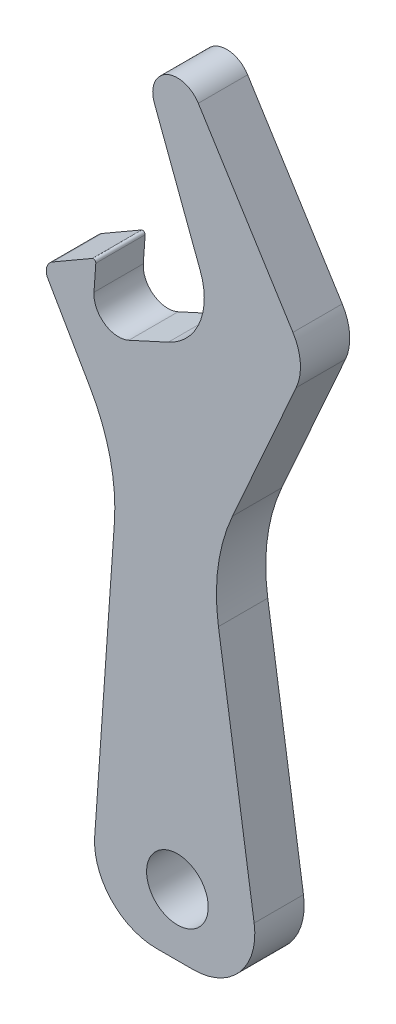
ISO-10303-21;
HEADER;
FILE_DESCRIPTION(('STEP AP214'),'2;1');
FILE_NAME('part.step','',(''),(''),'','','');
FILE_SCHEMA(('AUTOMOTIVE_DESIGN { 1 0 10303 214 1 1 1 1 }'));
ENDSEC;
DATA;
#1=APPLICATION_CONTEXT('core data for automotive mechanical design processes');
#2=APPLICATION_PROTOCOL_DEFINITION('international standard','automotive_design',2000,#1);
#3=PRODUCT_CONTEXT('',#1,'mechanical');
#4=PRODUCT('Part','Part','',(#3));
#5=PRODUCT_RELATED_PRODUCT_CATEGORY('part','',(#4));
#6=PRODUCT_DEFINITION_FORMATION('','',#4);
#7=PRODUCT_DEFINITION_CONTEXT('part definition',#1,'design');
#8=PRODUCT_DEFINITION('design','',#6,#7);
#9=PRODUCT_DEFINITION_SHAPE('','',#8);
#10=(LENGTH_UNIT() NAMED_UNIT(*) SI_UNIT(.MILLI.,.METRE.));
#11=(NAMED_UNIT(*) PLANE_ANGLE_UNIT() SI_UNIT($,.RADIAN.));
#12=(NAMED_UNIT(*) SI_UNIT($,.STERADIAN.) SOLID_ANGLE_UNIT());
#13=UNCERTAINTY_MEASURE_WITH_UNIT(LENGTH_MEASURE(1.E-05),#10,'distance_accuracy_value','');
#14=(GEOMETRIC_REPRESENTATION_CONTEXT(3) GLOBAL_UNCERTAINTY_ASSIGNED_CONTEXT((#13)) GLOBAL_UNIT_ASSIGNED_CONTEXT((#10,
#11,#12)) REPRESENTATION_CONTEXT('',''));
#15=CARTESIAN_POINT('',(0.,0.,0.));
#16=DIRECTION('',(0.,0.,1.));
#17=DIRECTION('',(1.,0.,0.));
#18=AXIS2_PLACEMENT_3D('',#15,#16,#17);
#19=CARTESIAN_POINT('',(0.,55.,4.));
#20=DIRECTION('',(0.,0.,1.));
#21=DIRECTION('',(1.,0.,0.));
#22=AXIS2_PLACEMENT_3D('',#19,#20,#21);
#23=PLANE('',#22);
#24=CARTESIAN_POINT('',(0.,55.,4.));
#25=DIRECTION('',(0.,0.,1.));
#26=DIRECTION('',(1.,0.,0.));
#27=AXIS2_PLACEMENT_3D('',#24,#25,#26);
#28=CIRCLE('',#27,2.);
#29=CARTESIAN_POINT('',(1.69510173893988,56.0614283276053,4.));
#30=VERTEX_POINT('',#29);
#31=CARTESIAN_POINT('',(-1.87218432235633,54.2964903247835,4.));
#32=VERTEX_POINT('',#31);
#33=EDGE_CURVE('E242',#30,#32,#28,.T.);
#34=ORIENTED_EDGE('',*,*,#33,.T.);
#35=DIRECTION('',(0.351754837608238,-0.936092161178162,0.));
#36=VECTOR('',#35,1.);
#37=CARTESIAN_POINT('',(-1.87218432235633,54.2964903247835,4.));
#38=LINE('',#37,#36);
#39=CARTESIAN_POINT('',(1.85912681998929,44.3667019101702,4.));
#40=VERTEX_POINT('',#39);
#41=EDGE_CURVE('E130',#32,#40,#38,.T.);
#42=ORIENTED_EDGE('',*,*,#41,.T.);
#43=CARTESIAN_POINT('',(-2.8213339859015,42.607927722129,4.));
#44=DIRECTION('',(0.,0.,-1.));
#45=DIRECTION('',(-1.,0.,0.));
#46=AXIS2_PLACEMENT_3D('',#43,#44,#45);
#47=CIRCLE('',#46,5.);
#48=CARTESIAN_POINT('',(-0.742535184562563,38.0605553442,4.));
#49=VERTEX_POINT('',#48);
#50=EDGE_CURVE('E293',#40,#49,#47,.T.);
#51=ORIENTED_EDGE('',*,*,#50,.T.);
#52=DIRECTION('',(-0.909474475585801,-0.415759760267793,0.));
#53=VECTOR('',#52,1.);
#54=CARTESIAN_POINT('',(-0.742535184562563,38.0605553442,4.));
#55=LINE('',#54,#53);
#56=CARTESIAN_POINT('',(-3.93853906050979,36.5995250009098,4.));
#57=VERTEX_POINT('',#56);
#58=EDGE_CURVE('E312',#49,#57,#55,.T.);
#59=ORIENTED_EDGE('',*,*,#58,.T.);
#60=CARTESIAN_POINT('',(-4.7700585810454,38.4184739520814,4.));
#61=DIRECTION('',(0.,0.,-1.));
#62=DIRECTION('',(-1.,0.,0.));
#63=AXIS2_PLACEMENT_3D('',#60,#61,#62);
#64=CIRCLE('',#63,2.);
#65=CARTESIAN_POINT('',(-6.76518668156505,38.5579868995697,4.));
#66=VERTEX_POINT('',#65);
#67=EDGE_CURVE('E309',#57,#66,#64,.T.);
#68=ORIENTED_EDGE('',*,*,#67,.T.);
#69=DIRECTION('',(0.0697564737441167,0.997564050259825,0.));
#70=VECTOR('',#69,1.);
#71=CARTESIAN_POINT('',(-6.76518668156505,38.5579868995697,4.));
#72=LINE('',#71,#70);
#73=CARTESIAN_POINT('',(-6.61748888501032,40.6701637949509,4.));
#74=VERTEX_POINT('',#73);
#75=EDGE_CURVE('E311',#66,#74,#72,.T.);
#76=ORIENTED_EDGE('',*,*,#75,.T.);
#77=CARTESIAN_POINT('',(-6.81700169506228,40.6841150896997,4.));
#78=DIRECTION('',(0.,0.,1.));
#79=DIRECTION('',(-1.,0.,0.));
#80=AXIS2_PLACEMENT_3D('',#77,#78,#79);
#81=CIRCLE('',#80,0.199999999999999);
#82=CARTESIAN_POINT('',(-6.91700169506228,40.8573201704566,4.));
#83=VERTEX_POINT('',#82);
#84=EDGE_CURVE('E314',#74,#83,#81,.T.);
#85=ORIENTED_EDGE('',*,*,#84,.T.);
#86=DIRECTION('',(-0.866025403784437,-0.500000000000003,0.));
#87=VECTOR('',#86,1.);
#88=CARTESIAN_POINT('',(-6.91700169506228,40.8573201704566,4.));
#89=LINE('',#88,#87);
#90=CARTESIAN_POINT('',(-10.1339745962156,39.,4.));
#91=VERTEX_POINT('',#90);
#92=EDGE_CURVE('E320',#83,#91,#89,.T.);
#93=ORIENTED_EDGE('',*,*,#92,.T.);
#94=CARTESIAN_POINT('',(-9.63397459621556,38.1339745962156,4.));
#95=DIRECTION('',(0.,0.,1.));
#96=DIRECTION('',(1.,0.,0.));
#97=AXIS2_PLACEMENT_3D('',#94,#95,#96);
#98=CIRCLE('',#97,1.);
#99=CARTESIAN_POINT('',(-10.5,37.6339745962156,4.));
#100=VERTEX_POINT('',#99);
#101=EDGE_CURVE('E322',#91,#100,#98,.T.);
#102=ORIENTED_EDGE('',*,*,#101,.T.);
#103=DIRECTION('',(0.500000000000006,-0.866025403784435,0.));
#104=VECTOR('',#103,1.);
#105=CARTESIAN_POINT('',(-10.5,37.6339745962156,4.));
#106=LINE('',#105,#104);
#107=CARTESIAN_POINT('',(-7.08532915368752,31.7195911992782,4.));
#108=VERTEX_POINT('',#107);
#109=EDGE_CURVE('E324',#100,#108,#106,.T.);
#110=ORIENTED_EDGE('',*,*,#109,.T.);
#111=CARTESIAN_POINT('',(-20.0757102104541,24.2195911992781,4.));
#112=DIRECTION('',(0.,0.,-1.));
#113=DIRECTION('',(-1.,0.,0.));
#114=AXIS2_PLACEMENT_3D('',#111,#112,#113);
#115=CIRCLE('',#114,15.);
#116=CARTESIAN_POINT('',(-5.11224945655669,23.1732440931163,4.));
#117=VERTEX_POINT('',#116);
#118=EDGE_CURVE('E326',#108,#117,#115,.T.);
#119=ORIENTED_EDGE('',*,*,#118,.T.);
#120=DIRECTION('',(-0.0697564737441258,-0.997564050259824,0.));
#121=VECTOR('',#120,1.);
#122=CARTESIAN_POINT('',(-5.11224945655669,23.1732440931163,4.));
#123=LINE('',#122,#121);
#124=CARTESIAN_POINT('',(-6.70829129927037,0.348782368720628,4.));
#125=VERTEX_POINT('',#124);
#126=EDGE_CURVE('E328',#117,#125,#123,.T.);
#127=ORIENTED_EDGE('',*,*,#126,.T.);
#128=CARTESIAN_POINT('',(-1.72047104797125,0.,4.));
#129=DIRECTION('',(0.,0.,1.));
#130=DIRECTION('',(-1.,0.,0.));
#131=AXIS2_PLACEMENT_3D('',#128,#129,#130);
#132=CIRCLE('',#131,5.);
#133=CARTESIAN_POINT('',(-1.72047104797125,-5.,4.));
#134=VERTEX_POINT('',#133);
#135=EDGE_CURVE('E330',#125,#134,#132,.T.);
#136=ORIENTED_EDGE('',*,*,#135,.T.);
#137=DIRECTION('',(1.,0.,0.));
#138=VECTOR('',#137,1.);
#139=CARTESIAN_POINT('',(-1.72047104797125,-5.,4.));
#140=LINE('',#139,#138);
#141=CARTESIAN_POINT('',(1.27952895202875,-5.,4.));
#142=VERTEX_POINT('',#141);
#143=EDGE_CURVE('E332',#134,#142,#140,.T.);
#144=ORIENTED_EDGE('',*,*,#143,.T.);
#145=CARTESIAN_POINT('',(1.27952895202875,0.,4.));
#146=DIRECTION('',(0.,0.,1.));
#147=DIRECTION('',(1.,0.,0.));
#148=AXIS2_PLACEMENT_3D('',#145,#146,#147);
#149=CIRCLE('',#148,5.);
#150=CARTESIAN_POINT('',(6.22460826883834,0.739047055648021,4.));
#151=VERTEX_POINT('',#150);
#152=EDGE_CURVE('E334',#142,#151,#149,.T.);
#153=ORIENTED_EDGE('',*,*,#152,.T.);
#154=DIRECTION('',(-0.147809411129604,0.989015863361918,0.));
#155=VECTOR('',#154,1.);
#156=CARTESIAN_POINT('',(6.22460826883834,0.739047055648021,4.));
#157=LINE('',#156,#155);
#158=CARTESIAN_POINT('',(3.32854071791424,20.1170875156033,4.));
#159=VERTEX_POINT('',#158);
#160=EDGE_CURVE('E336',#151,#159,#157,.T.);
#161=ORIENTED_EDGE('',*,*,#160,.T.);
#162=CARTESIAN_POINT('',(18.163778668343,22.3342286825474,4.));
#163=DIRECTION('',(0.,0.,-1.));
#164=DIRECTION('',(-1.,0.,0.));
#165=AXIS2_PLACEMENT_3D('',#162,#163,#164);
#166=CIRCLE('',#165,15.);
#167=CARTESIAN_POINT('',(4.46059680370396,28.4352783286843,4.));
#168=VERTEX_POINT('',#167);
#169=EDGE_CURVE('E185',#159,#168,#166,.T.);
#170=ORIENTED_EDGE('',*,*,#169,.T.);
#171=DIRECTION('',(0.406736643075797,0.913545457642602,0.));
#172=VECTOR('',#171,1.);
#173=CARTESIAN_POINT('',(4.46059680370396,28.4352783286843,4.));
#174=LINE('',#173,#172);
#175=CARTESIAN_POINT('',(9.63395857258165,40.0548391062939,4.));
#176=VERTEX_POINT('',#175);
#177=EDGE_CURVE('E179',#168,#176,#174,.T.);
#178=ORIENTED_EDGE('',*,*,#177,.T.);
#179=CARTESIAN_POINT('',(5.97977674201125,41.6817856785971,4.));
#180=DIRECTION('',(0.,0.,1.));
#181=DIRECTION('',(1.,0.,0.));
#182=AXIS2_PLACEMENT_3D('',#179,#180,#181);
#183=CIRCLE('',#182,4.);
#184=CARTESIAN_POINT('',(9.36998021989102,43.8046423338077,4.));
#185=VERTEX_POINT('',#184);
#186=EDGE_CURVE('E183',#176,#185,#183,.T.);
#187=ORIENTED_EDGE('',*,*,#186,.T.);
#188=DIRECTION('',(-0.530714163802647,0.847550869469943,0.));
#189=VECTOR('',#188,1.);
#190=CARTESIAN_POINT('',(9.36998021989102,43.8046423338077,4.));
#191=LINE('',#190,#189);
#192=EDGE_CURVE('E51',#185,#30,#191,.T.);
#193=ORIENTED_EDGE('',*,*,#192,.T.);
#194=EDGE_LOOP('',(#34,#42,#51,#59,#68,#76,#85,#93,#102,#110,#119,#127,#136,#144,#153,#161,#170,
#178,#187,#193));
#195=FACE_BOUND('',#194,.T.);
#196=CARTESIAN_POINT('',(0.,0.,4.));
#197=DIRECTION('',(0.,0.,1.));
#198=DIRECTION('',(1.,0.,0.));
#199=AXIS2_PLACEMENT_3D('',#196,#197,#198);
#200=CIRCLE('',#199,2.5);
#201=CARTESIAN_POINT('',(2.5,0.,4.));
#202=VERTEX_POINT('',#201);
#203=EDGE_CURVE('E207',#202,#202,#200,.T.);
#204=ORIENTED_EDGE('',*,*,#203,.F.);
#205=EDGE_LOOP('',(#204));
#206=FACE_BOUND('',#205,.T.);
#207=ADVANCED_FACE('F34',(#195,#206),#23,.T.);
#208=CARTESIAN_POINT('',(0.,55.,0.));
#209=DIRECTION('',(0.,0.,1.));
#210=DIRECTION('',(1.,0.,0.));
#211=AXIS2_PLACEMENT_3D('',#208,#209,#210);
#212=PLANE('',#211);
#213=CARTESIAN_POINT('',(0.,55.,0.));
#214=DIRECTION('',(0.,0.,1.));
#215=DIRECTION('',(1.,0.,0.));
#216=AXIS2_PLACEMENT_3D('',#213,#214,#215);
#217=CIRCLE('',#216,2.);
#218=CARTESIAN_POINT('',(1.69510173893988,56.0614283276053,0.));
#219=VERTEX_POINT('',#218);
#220=CARTESIAN_POINT('',(-1.87218432235633,54.2964903247835,0.));
#221=VERTEX_POINT('',#220);
#222=EDGE_CURVE('E203',#219,#221,#217,.T.);
#223=ORIENTED_EDGE('',*,*,#222,.F.);
#224=DIRECTION('',(-0.530714163802647,0.847550869469943,0.));
#225=VECTOR('',#224,1.);
#226=CARTESIAN_POINT('',(9.36998021989102,43.8046423338077,0.));
#227=LINE('',#226,#225);
#228=CARTESIAN_POINT('',(9.36998021989102,43.8046423338077,0.));
#229=VERTEX_POINT('',#228);
#230=EDGE_CURVE('E122',#229,#219,#227,.T.);
#231=ORIENTED_EDGE('',*,*,#230,.F.);
#232=CARTESIAN_POINT('',(5.97977674201125,41.6817856785971,0.));
#233=DIRECTION('',(0.,0.,1.));
#234=DIRECTION('',(1.,0.,0.));
#235=AXIS2_PLACEMENT_3D('',#232,#233,#234);
#236=CIRCLE('',#235,4.);
#237=CARTESIAN_POINT('',(9.63395857258165,40.0548391062939,0.));
#238=VERTEX_POINT('',#237);
#239=EDGE_CURVE('E116',#238,#229,#236,.T.);
#240=ORIENTED_EDGE('',*,*,#239,.F.);
#241=DIRECTION('',(0.406736643075797,0.913545457642602,0.));
#242=VECTOR('',#241,1.);
#243=CARTESIAN_POINT('',(4.46059680370396,28.4352783286843,0.));
#244=LINE('',#243,#242);
#245=CARTESIAN_POINT('',(4.46059680370396,28.4352783286843,0.));
#246=VERTEX_POINT('',#245);
#247=EDGE_CURVE('E193',#246,#238,#244,.T.);
#248=ORIENTED_EDGE('',*,*,#247,.F.);
#249=CARTESIAN_POINT('',(18.163778668343,22.3342286825474,0.));
#250=DIRECTION('',(0.,0.,-1.));
#251=DIRECTION('',(-1.,0.,0.));
#252=AXIS2_PLACEMENT_3D('',#249,#250,#251);
#253=CIRCLE('',#252,15.);
#254=CARTESIAN_POINT('',(3.32854071791424,20.1170875156033,0.));
#255=VERTEX_POINT('',#254);
#256=EDGE_CURVE('E237',#255,#246,#253,.T.);
#257=ORIENTED_EDGE('',*,*,#256,.F.);
#258=DIRECTION('',(-0.147809411129604,0.989015863361918,0.));
#259=VECTOR('',#258,1.);
#260=CARTESIAN_POINT('',(6.22460826883834,0.739047055648021,0.));
#261=LINE('',#260,#259);
#262=CARTESIAN_POINT('',(6.22460826883834,0.739047055648021,0.));
#263=VERTEX_POINT('',#262);
#264=EDGE_CURVE('E235',#263,#255,#261,.T.);
#265=ORIENTED_EDGE('',*,*,#264,.F.);
#266=CARTESIAN_POINT('',(1.27952895202875,0.,0.));
#267=DIRECTION('',(0.,0.,1.));
#268=DIRECTION('',(1.,0.,0.));
#269=AXIS2_PLACEMENT_3D('',#266,#267,#268);
#270=CIRCLE('',#269,5.);
#271=CARTESIAN_POINT('',(1.27952895202875,-5.,0.));
#272=VERTEX_POINT('',#271);
#273=EDGE_CURVE('E233',#272,#263,#270,.T.);
#274=ORIENTED_EDGE('',*,*,#273,.F.);
#275=DIRECTION('',(1.,0.,0.));
#276=VECTOR('',#275,1.);
#277=CARTESIAN_POINT('',(-1.72047104797125,-5.,0.));
#278=LINE('',#277,#276);
#279=CARTESIAN_POINT('',(-1.72047104797125,-5.,0.));
#280=VERTEX_POINT('',#279);
#281=EDGE_CURVE('E231',#280,#272,#278,.T.);
#282=ORIENTED_EDGE('',*,*,#281,.F.);
#283=CARTESIAN_POINT('',(-1.72047104797125,0.,0.));
#284=DIRECTION('',(0.,0.,1.));
#285=DIRECTION('',(-1.,0.,0.));
#286=AXIS2_PLACEMENT_3D('',#283,#284,#285);
#287=CIRCLE('',#286,5.);
#288=CARTESIAN_POINT('',(-6.70829129927037,0.348782368720628,0.));
#289=VERTEX_POINT('',#288);
#290=EDGE_CURVE('E229',#289,#280,#287,.T.);
#291=ORIENTED_EDGE('',*,*,#290,.F.);
#292=DIRECTION('',(-0.0697564737441258,-0.997564050259824,0.));
#293=VECTOR('',#292,1.);
#294=CARTESIAN_POINT('',(-5.11224945655669,23.1732440931163,0.));
#295=LINE('',#294,#293);
#296=CARTESIAN_POINT('',(-5.11224945655669,23.1732440931163,0.));
#297=VERTEX_POINT('',#296);
#298=EDGE_CURVE('E227',#297,#289,#295,.T.);
#299=ORIENTED_EDGE('',*,*,#298,.F.);
#300=CARTESIAN_POINT('',(-20.0757102104541,24.2195911992781,0.));
#301=DIRECTION('',(0.,0.,-1.));
#302=DIRECTION('',(-1.,0.,0.));
#303=AXIS2_PLACEMENT_3D('',#300,#301,#302);
#304=CIRCLE('',#303,15.);
#305=CARTESIAN_POINT('',(-7.08532915368752,31.7195911992782,0.));
#306=VERTEX_POINT('',#305);
#307=EDGE_CURVE('E225',#306,#297,#304,.T.);
#308=ORIENTED_EDGE('',*,*,#307,.F.);
#309=DIRECTION('',(0.500000000000006,-0.866025403784435,0.));
#310=VECTOR('',#309,1.);
#311=CARTESIAN_POINT('',(-10.5,37.6339745962156,0.));
#312=LINE('',#311,#310);
#313=CARTESIAN_POINT('',(-10.5,37.6339745962156,0.));
#314=VERTEX_POINT('',#313);
#315=EDGE_CURVE('E223',#314,#306,#312,.T.);
#316=ORIENTED_EDGE('',*,*,#315,.F.);
#317=CARTESIAN_POINT('',(-9.63397459621556,38.1339745962156,0.));
#318=DIRECTION('',(0.,0.,1.));
#319=DIRECTION('',(1.,0.,0.));
#320=AXIS2_PLACEMENT_3D('',#317,#318,#319);
#321=CIRCLE('',#320,1.);
#322=CARTESIAN_POINT('',(-10.1339745962156,39.,0.));
#323=VERTEX_POINT('',#322);
#324=EDGE_CURVE('E221',#323,#314,#321,.T.);
#325=ORIENTED_EDGE('',*,*,#324,.F.);
#326=DIRECTION('',(-0.866025403784437,-0.500000000000003,0.));
#327=VECTOR('',#326,1.);
#328=CARTESIAN_POINT('',(-6.91700169506228,40.8573201704566,0.));
#329=LINE('',#328,#327);
#330=CARTESIAN_POINT('',(-6.91700169506228,40.8573201704566,0.));
#331=VERTEX_POINT('',#330);
#332=EDGE_CURVE('E219',#331,#323,#329,.T.);
#333=ORIENTED_EDGE('',*,*,#332,.F.);
#334=CARTESIAN_POINT('',(-6.81700169506228,40.6841150896997,0.));
#335=DIRECTION('',(0.,0.,1.));
#336=DIRECTION('',(-1.,0.,0.));
#337=AXIS2_PLACEMENT_3D('',#334,#335,#336);
#338=CIRCLE('',#337,0.199999999999999);
#339=CARTESIAN_POINT('',(-6.61748888501032,40.6701637949509,0.));
#340=VERTEX_POINT('',#339);
#341=EDGE_CURVE('E217',#340,#331,#338,.T.);
#342=ORIENTED_EDGE('',*,*,#341,.F.);
#343=DIRECTION('',(0.0697564737441167,0.997564050259825,0.));
#344=VECTOR('',#343,1.);
#345=CARTESIAN_POINT('',(-6.76518668156505,38.5579868995697,0.));
#346=LINE('',#345,#344);
#347=CARTESIAN_POINT('',(-6.76518668156505,38.5579868995697,0.));
#348=VERTEX_POINT('',#347);
#349=EDGE_CURVE('E215',#348,#340,#346,.T.);
#350=ORIENTED_EDGE('',*,*,#349,.F.);
#351=CARTESIAN_POINT('',(-4.7700585810454,38.4184739520814,0.));
#352=DIRECTION('',(0.,0.,-1.));
#353=DIRECTION('',(-1.,0.,0.));
#354=AXIS2_PLACEMENT_3D('',#351,#352,#353);
#355=CIRCLE('',#354,2.);
#356=CARTESIAN_POINT('',(-3.93853906050979,36.5995250009098,0.));
#357=VERTEX_POINT('',#356);
#358=EDGE_CURVE('E213',#357,#348,#355,.T.);
#359=ORIENTED_EDGE('',*,*,#358,.F.);
#360=DIRECTION('',(-0.909474475585801,-0.415759760267793,0.));
#361=VECTOR('',#360,1.);
#362=CARTESIAN_POINT('',(-0.742535184562563,38.0605553442,0.));
#363=LINE('',#362,#361);
#364=CARTESIAN_POINT('',(-0.742535184562563,38.0605553442,0.));
#365=VERTEX_POINT('',#364);
#366=EDGE_CURVE('E211',#365,#357,#363,.T.);
#367=ORIENTED_EDGE('',*,*,#366,.F.);
#368=CARTESIAN_POINT('',(-2.8213339859015,42.607927722129,0.));
#369=DIRECTION('',(0.,0.,-1.));
#370=DIRECTION('',(-1.,0.,0.));
#371=AXIS2_PLACEMENT_3D('',#368,#369,#370);
#372=CIRCLE('',#371,5.);
#373=CARTESIAN_POINT('',(1.85912681998929,44.3667019101702,0.));
#374=VERTEX_POINT('',#373);
#375=EDGE_CURVE('E209',#374,#365,#372,.T.);
#376=ORIENTED_EDGE('',*,*,#375,.F.);
#377=DIRECTION('',(0.351754837608238,-0.936092161178162,0.));
#378=VECTOR('',#377,1.);
#379=CARTESIAN_POINT('',(-1.87218432235633,54.2964903247835,0.));
#380=LINE('',#379,#378);
#381=EDGE_CURVE('E206',#221,#374,#380,.T.);
#382=ORIENTED_EDGE('',*,*,#381,.F.);
#383=EDGE_LOOP('',(#223,#231,#240,#248,#257,#265,#274,#282,#291,#299,#308,#316,#325,#333,#342,
#350,#359,#367,#376,#382));
#384=FACE_BOUND('',#383,.T.);
#385=CARTESIAN_POINT('',(0.,0.,0.));
#386=DIRECTION('',(0.,0.,1.));
#387=DIRECTION('',(1.,0.,0.));
#388=AXIS2_PLACEMENT_3D('',#385,#386,#387);
#389=CIRCLE('',#388,2.5);
#390=CARTESIAN_POINT('',(2.5,0.,0.));
#391=VERTEX_POINT('',#390);
#392=EDGE_CURVE('E587',#391,#391,#389,.T.);
#393=ORIENTED_EDGE('',*,*,#392,.T.);
#394=EDGE_LOOP('',(#393));
#395=FACE_BOUND('',#394,.T.);
#396=ADVANCED_FACE('F297',(#384,#395),#212,.F.);
#397=CARTESIAN_POINT('',(0.,55.,4.));
#398=DIRECTION('',(0.,0.,-1.));
#399=DIRECTION('',(-1.,0.,0.));
#400=AXIS2_PLACEMENT_3D('',#397,#398,#399);
#401=CYLINDRICAL_SURFACE('',#400,2.);
#402=ORIENTED_EDGE('',*,*,#222,.T.);
#403=DIRECTION('',(0.,0.,-1.));
#404=VECTOR('',#403,1.);
#405=CARTESIAN_POINT('',(-1.87218432235633,54.2964903247835,4.));
#406=LINE('',#405,#404);
#407=EDGE_CURVE('E11',#32,#221,#406,.T.);
#408=ORIENTED_EDGE('',*,*,#407,.F.);
#409=ORIENTED_EDGE('',*,*,#33,.F.);
#410=DIRECTION('',(0.,0.,-1.));
#411=VECTOR('',#410,1.);
#412=CARTESIAN_POINT('',(1.69510173893988,56.0614283276053,4.));
#413=LINE('',#412,#411);
#414=EDGE_CURVE('E199',#30,#219,#413,.T.);
#415=ORIENTED_EDGE('',*,*,#414,.T.);
#416=EDGE_LOOP('',(#402,#408,#409,#415));
#417=FACE_BOUND('',#416,.T.);
#418=ADVANCED_FACE('F36',(#417),#401,.T.);
#419=CARTESIAN_POINT('',(-1.87218432235633,54.2964903247835,4.));
#420=DIRECTION('',(0.936092161178162,0.351754837608238,0.));
#421=DIRECTION('',(-0.351754837608238,0.936092161178162,0.));
#422=AXIS2_PLACEMENT_3D('',#419,#420,#421);
#423=PLANE('',#422);
#424=ORIENTED_EDGE('',*,*,#381,.T.);
#425=DIRECTION('',(0.,0.,-1.));
#426=VECTOR('',#425,1.);
#427=CARTESIAN_POINT('',(1.85912681998929,44.3667019101702,4.));
#428=LINE('',#427,#426);
#429=EDGE_CURVE('E43',#40,#374,#428,.T.);
#430=ORIENTED_EDGE('',*,*,#429,.F.);
#431=ORIENTED_EDGE('',*,*,#41,.F.);
#432=ORIENTED_EDGE('',*,*,#407,.T.);
#433=EDGE_LOOP('',(#424,#430,#431,#432));
#434=FACE_BOUND('',#433,.T.);
#435=ADVANCED_FACE('F370',(#434),#423,.F.);
#436=CARTESIAN_POINT('',(-2.8213339859015,42.607927722129,4.));
#437=DIRECTION('',(0.,0.,-1.));
#438=DIRECTION('',(-1.,0.,0.));
#439=AXIS2_PLACEMENT_3D('',#436,#437,#438);
#440=CYLINDRICAL_SURFACE('',#439,5.);
#441=ORIENTED_EDGE('',*,*,#375,.T.);
#442=DIRECTION('',(0.,0.,-1.));
#443=VECTOR('',#442,1.);
#444=CARTESIAN_POINT('',(-0.742535184562563,38.0605553442,4.));
#445=LINE('',#444,#443);
#446=EDGE_CURVE('E285',#49,#365,#445,.T.);
#447=ORIENTED_EDGE('',*,*,#446,.F.);
#448=ORIENTED_EDGE('',*,*,#50,.F.);
#449=ORIENTED_EDGE('',*,*,#429,.T.);
#450=EDGE_LOOP('',(#441,#447,#448,#449));
#451=FACE_BOUND('',#450,.T.);
#452=ADVANCED_FACE('F291',(#451),#440,.F.);
#453=CARTESIAN_POINT('',(-0.742535184562563,38.0605553442,4.));
#454=DIRECTION('',(0.415759760267793,-0.909474475585801,0.));
#455=DIRECTION('',(0.909474475585801,0.415759760267793,0.));
#456=AXIS2_PLACEMENT_3D('',#453,#454,#455);
#457=PLANE('',#456);
#458=ORIENTED_EDGE('',*,*,#366,.T.);
#459=DIRECTION('',(0.,0.,-1.));
#460=VECTOR('',#459,1.);
#461=CARTESIAN_POINT('',(-3.93853906050979,36.5995250009098,4.));
#462=LINE('',#461,#460);
#463=EDGE_CURVE('E282',#57,#357,#462,.T.);
#464=ORIENTED_EDGE('',*,*,#463,.F.);
#465=ORIENTED_EDGE('',*,*,#58,.F.);
#466=ORIENTED_EDGE('',*,*,#446,.T.);
#467=EDGE_LOOP('',(#458,#464,#465,#466));
#468=FACE_BOUND('',#467,.T.);
#469=ADVANCED_FACE('F303',(#468),#457,.F.);
#470=CARTESIAN_POINT('',(-4.7700585810454,38.4184739520814,4.));
#471=DIRECTION('',(0.,0.,-1.));
#472=DIRECTION('',(-1.,0.,0.));
#473=AXIS2_PLACEMENT_3D('',#470,#471,#472);
#474=CYLINDRICAL_SURFACE('',#473,2.);
#475=ORIENTED_EDGE('',*,*,#358,.T.);
#476=DIRECTION('',(0.,0.,-1.));
#477=VECTOR('',#476,1.);
#478=CARTESIAN_POINT('',(-6.76518668156505,38.5579868995697,4.));
#479=LINE('',#478,#477);
#480=EDGE_CURVE('E279',#66,#348,#479,.T.);
#481=ORIENTED_EDGE('',*,*,#480,.F.);
#482=ORIENTED_EDGE('',*,*,#67,.F.);
#483=ORIENTED_EDGE('',*,*,#463,.T.);
#484=EDGE_LOOP('',(#475,#481,#482,#483));
#485=FACE_BOUND('',#484,.T.);
#486=ADVANCED_FACE('F307',(#485),#474,.F.);
#487=CARTESIAN_POINT('',(-6.76518668156505,38.5579868995697,4.));
#488=DIRECTION('',(-0.997564050259825,0.0697564737441167,0.));
#489=DIRECTION('',(-0.0697564737441167,-0.997564050259825,0.));
#490=AXIS2_PLACEMENT_3D('',#487,#488,#489);
#491=PLANE('',#490);
#492=ORIENTED_EDGE('',*,*,#349,.T.);
#493=DIRECTION('',(0.,0.,-1.));
#494=VECTOR('',#493,1.);
#495=CARTESIAN_POINT('',(-6.61748888501032,40.6701637949509,4.));
#496=LINE('',#495,#494);
#497=EDGE_CURVE('E276',#74,#340,#496,.T.);
#498=ORIENTED_EDGE('',*,*,#497,.F.);
#499=ORIENTED_EDGE('',*,*,#75,.F.);
#500=ORIENTED_EDGE('',*,*,#480,.T.);
#501=EDGE_LOOP('',(#492,#498,#499,#500));
#502=FACE_BOUND('',#501,.T.);
#503=ADVANCED_FACE('F383',(#502),#491,.F.);
#504=CARTESIAN_POINT('',(-6.81700169506228,40.6841150896997,4.));
#505=DIRECTION('',(0.,0.,-1.));
#506=DIRECTION('',(-1.,0.,0.));
#507=AXIS2_PLACEMENT_3D('',#504,#505,#506);
#508=CYLINDRICAL_SURFACE('',#507,0.199999999999999);
#509=ORIENTED_EDGE('',*,*,#341,.T.);
#510=DIRECTION('',(0.,0.,-1.));
#511=VECTOR('',#510,1.);
#512=CARTESIAN_POINT('',(-6.91700169506228,40.8573201704566,4.));
#513=LINE('',#512,#511);
#514=EDGE_CURVE('E273',#83,#331,#513,.T.);
#515=ORIENTED_EDGE('',*,*,#514,.F.);
#516=ORIENTED_EDGE('',*,*,#84,.F.);
#517=ORIENTED_EDGE('',*,*,#497,.T.);
#518=EDGE_LOOP('',(#509,#515,#516,#517));
#519=FACE_BOUND('',#518,.T.);
#520=ADVANCED_FACE('F386',(#519),#508,.T.);
#521=CARTESIAN_POINT('',(-6.91700169506228,40.8573201704566,4.));
#522=DIRECTION('',(0.500000000000003,-0.866025403784437,0.));
#523=DIRECTION('',(0.866025403784437,0.500000000000003,0.));
#524=AXIS2_PLACEMENT_3D('',#521,#522,#523);
#525=PLANE('',#524);
#526=ORIENTED_EDGE('',*,*,#332,.T.);
#527=DIRECTION('',(0.,0.,-1.));
#528=VECTOR('',#527,1.);
#529=CARTESIAN_POINT('',(-10.1339745962156,39.,4.));
#530=LINE('',#529,#528);
#531=EDGE_CURVE('E270',#91,#323,#530,.T.);
#532=ORIENTED_EDGE('',*,*,#531,.F.);
#533=ORIENTED_EDGE('',*,*,#92,.F.);
#534=ORIENTED_EDGE('',*,*,#514,.T.);
#535=EDGE_LOOP('',(#526,#532,#533,#534));
#536=FACE_BOUND('',#535,.T.);
#537=ADVANCED_FACE('F390',(#536),#525,.F.);
#538=CARTESIAN_POINT('',(-9.63397459621556,38.1339745962156,4.));
#539=DIRECTION('',(0.,0.,-1.));
#540=DIRECTION('',(-1.,0.,0.));
#541=AXIS2_PLACEMENT_3D('',#538,#539,#540);
#542=CYLINDRICAL_SURFACE('',#541,1.);
#543=ORIENTED_EDGE('',*,*,#324,.T.);
#544=DIRECTION('',(0.,0.,-1.));
#545=VECTOR('',#544,1.);
#546=CARTESIAN_POINT('',(-10.5,37.6339745962156,4.));
#547=LINE('',#546,#545);
#548=EDGE_CURVE('E267',#100,#314,#547,.T.);
#549=ORIENTED_EDGE('',*,*,#548,.F.);
#550=ORIENTED_EDGE('',*,*,#101,.F.);
#551=ORIENTED_EDGE('',*,*,#531,.T.);
#552=EDGE_LOOP('',(#543,#549,#550,#551));
#553=FACE_BOUND('',#552,.T.);
#554=ADVANCED_FACE('F394',(#553),#542,.T.);
#555=CARTESIAN_POINT('',(-10.5,37.6339745962156,4.));
#556=DIRECTION('',(0.866025403784435,0.500000000000006,0.));
#557=DIRECTION('',(-0.500000000000006,0.866025403784435,0.));
#558=AXIS2_PLACEMENT_3D('',#555,#556,#557);
#559=PLANE('',#558);
#560=ORIENTED_EDGE('',*,*,#315,.T.);
#561=DIRECTION('',(0.,0.,-1.));
#562=VECTOR('',#561,1.);
#563=CARTESIAN_POINT('',(-7.08532915368752,31.7195911992782,4.));
#564=LINE('',#563,#562);
#565=EDGE_CURVE('E264',#108,#306,#564,.T.);
#566=ORIENTED_EDGE('',*,*,#565,.F.);
#567=ORIENTED_EDGE('',*,*,#109,.F.);
#568=ORIENTED_EDGE('',*,*,#548,.T.);
#569=EDGE_LOOP('',(#560,#566,#567,#568));
#570=FACE_BOUND('',#569,.T.);
#571=ADVANCED_FACE('F398',(#570),#559,.F.);
#572=CARTESIAN_POINT('',(-20.0757102104541,24.2195911992781,4.));
#573=DIRECTION('',(0.,0.,-1.));
#574=DIRECTION('',(-1.,0.,0.));
#575=AXIS2_PLACEMENT_3D('',#572,#573,#574);
#576=CYLINDRICAL_SURFACE('',#575,15.);
#577=ORIENTED_EDGE('',*,*,#307,.T.);
#578=DIRECTION('',(0.,0.,-1.));
#579=VECTOR('',#578,1.);
#580=CARTESIAN_POINT('',(-5.11224945655669,23.1732440931163,4.));
#581=LINE('',#580,#579);
#582=EDGE_CURVE('E261',#117,#297,#581,.T.);
#583=ORIENTED_EDGE('',*,*,#582,.F.);
#584=ORIENTED_EDGE('',*,*,#118,.F.);
#585=ORIENTED_EDGE('',*,*,#565,.T.);
#586=EDGE_LOOP('',(#577,#583,#584,#585));
#587=FACE_BOUND('',#586,.T.);
#588=ADVANCED_FACE('F402',(#587),#576,.F.);
#589=CARTESIAN_POINT('',(-5.11224945655669,23.1732440931163,4.));
#590=DIRECTION('',(0.997564050259824,-0.0697564737441258,0.));
#591=DIRECTION('',(0.0697564737441258,0.997564050259824,0.));
#592=AXIS2_PLACEMENT_3D('',#589,#590,#591);
#593=PLANE('',#592);
#594=ORIENTED_EDGE('',*,*,#298,.T.);
#595=DIRECTION('',(0.,0.,-1.));
#596=VECTOR('',#595,1.);
#597=CARTESIAN_POINT('',(-6.70829129927037,0.348782368720628,4.));
#598=LINE('',#597,#596);
#599=EDGE_CURVE('E258',#125,#289,#598,.T.);
#600=ORIENTED_EDGE('',*,*,#599,.F.);
#601=ORIENTED_EDGE('',*,*,#126,.F.);
#602=ORIENTED_EDGE('',*,*,#582,.T.);
#603=EDGE_LOOP('',(#594,#600,#601,#602));
#604=FACE_BOUND('',#603,.T.);
#605=ADVANCED_FACE('F406',(#604),#593,.F.);
#606=CARTESIAN_POINT('',(-1.72047104797125,0.,4.));
#607=DIRECTION('',(0.,0.,-1.));
#608=DIRECTION('',(-1.,0.,0.));
#609=AXIS2_PLACEMENT_3D('',#606,#607,#608);
#610=CYLINDRICAL_SURFACE('',#609,5.);
#611=ORIENTED_EDGE('',*,*,#290,.T.);
#612=DIRECTION('',(0.,0.,-1.));
#613=VECTOR('',#612,1.);
#614=CARTESIAN_POINT('',(-1.72047104797125,-5.,4.));
#615=LINE('',#614,#613);
#616=EDGE_CURVE('E255',#134,#280,#615,.T.);
#617=ORIENTED_EDGE('',*,*,#616,.F.);
#618=ORIENTED_EDGE('',*,*,#135,.F.);
#619=ORIENTED_EDGE('',*,*,#599,.T.);
#620=EDGE_LOOP('',(#611,#617,#618,#619));
#621=FACE_BOUND('',#620,.T.);
#622=ADVANCED_FACE('F410',(#621),#610,.T.);
#623=CARTESIAN_POINT('',(-1.72047104797125,-5.,4.));
#624=DIRECTION('',(0.,1.,0.));
#625=DIRECTION('',(0.,0.,1.));
#626=AXIS2_PLACEMENT_3D('',#623,#624,#625);
#627=PLANE('',#626);
#628=ORIENTED_EDGE('',*,*,#281,.T.);
#629=DIRECTION('',(0.,0.,-1.));
#630=VECTOR('',#629,1.);
#631=CARTESIAN_POINT('',(1.27952895202875,-5.,4.));
#632=LINE('',#631,#630);
#633=EDGE_CURVE('E252',#142,#272,#632,.T.);
#634=ORIENTED_EDGE('',*,*,#633,.F.);
#635=ORIENTED_EDGE('',*,*,#143,.F.);
#636=ORIENTED_EDGE('',*,*,#616,.T.);
#637=EDGE_LOOP('',(#628,#634,#635,#636));
#638=FACE_BOUND('',#637,.T.);
#639=ADVANCED_FACE('F414',(#638),#627,.F.);
#640=CARTESIAN_POINT('',(1.27952895202875,0.,4.));
#641=DIRECTION('',(0.,0.,-1.));
#642=DIRECTION('',(-1.,0.,0.));
#643=AXIS2_PLACEMENT_3D('',#640,#641,#642);
#644=CYLINDRICAL_SURFACE('',#643,5.);
#645=ORIENTED_EDGE('',*,*,#273,.T.);
#646=DIRECTION('',(0.,0.,-1.));
#647=VECTOR('',#646,1.);
#648=CARTESIAN_POINT('',(6.22460826883834,0.739047055648021,4.));
#649=LINE('',#648,#647);
#650=EDGE_CURVE('E249',#151,#263,#649,.T.);
#651=ORIENTED_EDGE('',*,*,#650,.F.);
#652=ORIENTED_EDGE('',*,*,#152,.F.);
#653=ORIENTED_EDGE('',*,*,#633,.T.);
#654=EDGE_LOOP('',(#645,#651,#652,#653));
#655=FACE_BOUND('',#654,.T.);
#656=ADVANCED_FACE('F418',(#655),#644,.T.);
#657=CARTESIAN_POINT('',(6.22460826883834,0.739047055648021,4.));
#658=DIRECTION('',(-0.989015863361918,-0.147809411129604,0.));
#659=DIRECTION('',(0.147809411129604,-0.989015863361918,0.));
#660=AXIS2_PLACEMENT_3D('',#657,#658,#659);
#661=PLANE('',#660);
#662=ORIENTED_EDGE('',*,*,#264,.T.);
#663=DIRECTION('',(0.,0.,-1.));
#664=VECTOR('',#663,1.);
#665=CARTESIAN_POINT('',(3.32854071791424,20.1170875156033,4.));
#666=LINE('',#665,#664);
#667=EDGE_CURVE('E246',#159,#255,#666,.T.);
#668=ORIENTED_EDGE('',*,*,#667,.F.);
#669=ORIENTED_EDGE('',*,*,#160,.F.);
#670=ORIENTED_EDGE('',*,*,#650,.T.);
#671=EDGE_LOOP('',(#662,#668,#669,#670));
#672=FACE_BOUND('',#671,.T.);
#673=ADVANCED_FACE('F342',(#672),#661,.F.);
#674=CARTESIAN_POINT('',(18.163778668343,22.3342286825474,4.));
#675=DIRECTION('',(0.,0.,-1.));
#676=DIRECTION('',(-1.,0.,0.));
#677=AXIS2_PLACEMENT_3D('',#674,#675,#676);
#678=CYLINDRICAL_SURFACE('',#677,15.);
#679=ORIENTED_EDGE('',*,*,#256,.T.);
#680=DIRECTION('',(0.,0.,-1.));
#681=VECTOR('',#680,1.);
#682=CARTESIAN_POINT('',(4.46059680370396,28.4352783286843,4.));
#683=LINE('',#682,#681);
#684=EDGE_CURVE('E194',#168,#246,#683,.T.);
#685=ORIENTED_EDGE('',*,*,#684,.F.);
#686=ORIENTED_EDGE('',*,*,#169,.F.);
#687=ORIENTED_EDGE('',*,*,#667,.T.);
#688=EDGE_LOOP('',(#679,#685,#686,#687));
#689=FACE_BOUND('',#688,.T.);
#690=ADVANCED_FACE('F346',(#689),#678,.F.);
#691=CARTESIAN_POINT('',(4.46059680370396,28.4352783286843,4.));
#692=DIRECTION('',(-0.913545457642602,0.406736643075798,0.));
#693=DIRECTION('',(-0.406736643075798,-0.913545457642602,0.));
#694=AXIS2_PLACEMENT_3D('',#691,#692,#693);
#695=PLANE('',#694);
#696=ORIENTED_EDGE('',*,*,#247,.T.);
#697=DIRECTION('',(0.,0.,-1.));
#698=VECTOR('',#697,1.);
#699=CARTESIAN_POINT('',(9.63395857258165,40.0548391062939,4.));
#700=LINE('',#699,#698);
#701=EDGE_CURVE('E190',#176,#238,#700,.T.);
#702=ORIENTED_EDGE('',*,*,#701,.F.);
#703=ORIENTED_EDGE('',*,*,#177,.F.);
#704=ORIENTED_EDGE('',*,*,#684,.T.);
#705=EDGE_LOOP('',(#696,#702,#703,#704));
#706=FACE_BOUND('',#705,.T.);
#707=ADVANCED_FACE('F191',(#706),#695,.F.);
#708=CARTESIAN_POINT('',(5.97977674201125,41.6817856785971,4.));
#709=DIRECTION('',(0.,0.,-1.));
#710=DIRECTION('',(-1.,0.,0.));
#711=AXIS2_PLACEMENT_3D('',#708,#709,#710);
#712=CYLINDRICAL_SURFACE('',#711,4.);
#713=ORIENTED_EDGE('',*,*,#239,.T.);
#714=DIRECTION('',(0.,0.,-1.));
#715=VECTOR('',#714,1.);
#716=CARTESIAN_POINT('',(9.36998021989102,43.8046423338077,4.));
#717=LINE('',#716,#715);
#718=EDGE_CURVE('E195',#185,#229,#717,.T.);
#719=ORIENTED_EDGE('',*,*,#718,.F.);
#720=ORIENTED_EDGE('',*,*,#186,.F.);
#721=ORIENTED_EDGE('',*,*,#701,.T.);
#722=EDGE_LOOP('',(#713,#719,#720,#721));
#723=FACE_BOUND('',#722,.T.);
#724=ADVANCED_FACE('F197',(#723),#712,.T.);
#725=CARTESIAN_POINT('',(9.36998021989102,43.8046423338077,4.));
#726=DIRECTION('',(-0.847550869469944,-0.530714163802647,0.));
#727=DIRECTION('',(0.530714163802647,-0.847550869469943,0.));
#728=AXIS2_PLACEMENT_3D('',#725,#726,#727);
#729=PLANE('',#728);
#730=ORIENTED_EDGE('',*,*,#230,.T.);
#731=ORIENTED_EDGE('',*,*,#414,.F.);
#732=ORIENTED_EDGE('',*,*,#192,.F.);
#733=ORIENTED_EDGE('',*,*,#718,.T.);
#734=EDGE_LOOP('',(#730,#731,#732,#733));
#735=FACE_BOUND('',#734,.T.);
#736=ADVANCED_FACE('F350',(#735),#729,.F.);
#737=CARTESIAN_POINT('',(0.,0.,4.));
#738=DIRECTION('',(0.,0.,-1.));
#739=DIRECTION('',(-1.,0.,0.));
#740=AXIS2_PLACEMENT_3D('',#737,#738,#739);
#741=CYLINDRICAL_SURFACE('',#740,2.5);
#742=ORIENTED_EDGE('',*,*,#203,.T.);
#743=EDGE_LOOP('',(#742));
#744=FACE_BOUND('',#743,.T.);
#745=ORIENTED_EDGE('',*,*,#392,.F.);
#746=EDGE_LOOP('',(#745));
#747=FACE_BOUND('',#746,.T.);
#748=ADVANCED_FACE('F352',(#744,#747),#741,.F.);
#749=CLOSED_SHELL('',(#207,#396,#418,#435,#452,#469,#486,#503,#520,#537,#554,#571,#588,#605,
#622,#639,#656,#673,#690,#707,#724,#736,#748));
#750=MANIFOLD_SOLID_BREP('B2',#749);
#751=ADVANCED_BREP_SHAPE_REPRESENTATION('',(#18,#750),#14);
#752=SHAPE_DEFINITION_REPRESENTATION(#9,#751);
ENDSEC;
END-ISO-10303-21;
